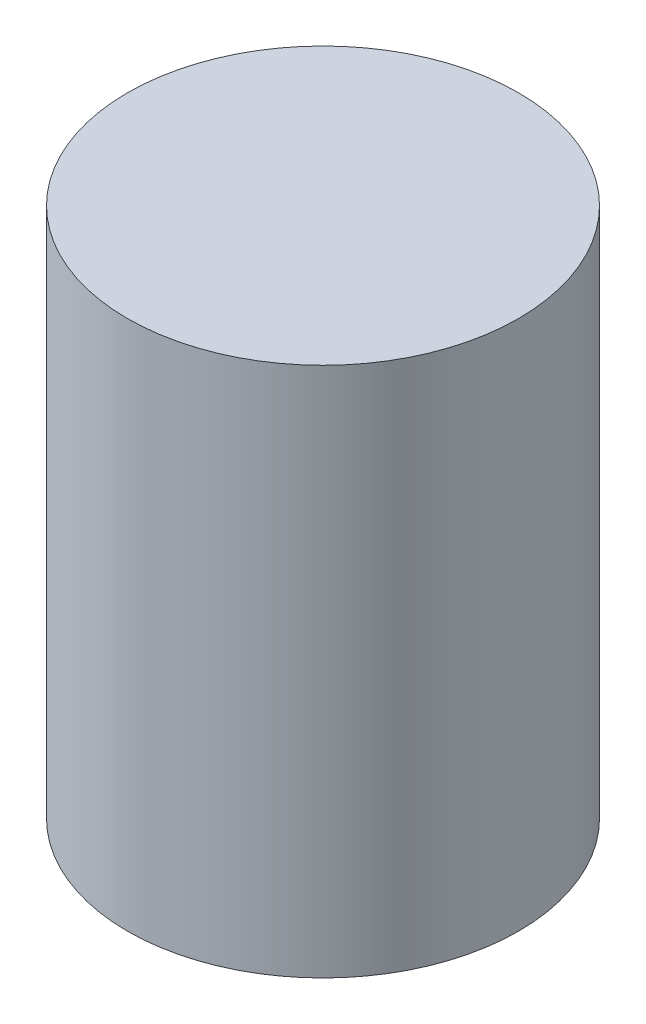
ISO-10303-21;
HEADER;
FILE_DESCRIPTION(('STEP AP214'),'2;1');
FILE_NAME('part.step','',(''),(''),'','','');
FILE_SCHEMA(('AUTOMOTIVE_DESIGN { 1 0 10303 214 1 1 1 1 }'));
ENDSEC;
DATA;
#1=APPLICATION_CONTEXT('core data for automotive mechanical design processes');
#2=APPLICATION_PROTOCOL_DEFINITION('international standard','automotive_design',2000,#1);
#3=PRODUCT_CONTEXT('',#1,'mechanical');
#4=PRODUCT('Part','Part','',(#3));
#5=PRODUCT_RELATED_PRODUCT_CATEGORY('part','',(#4));
#6=PRODUCT_DEFINITION_FORMATION('','',#4);
#7=PRODUCT_DEFINITION_CONTEXT('part definition',#1,'design');
#8=PRODUCT_DEFINITION('design','',#6,#7);
#9=PRODUCT_DEFINITION_SHAPE('','',#8);
#10=(LENGTH_UNIT() NAMED_UNIT(*) SI_UNIT(.MILLI.,.METRE.));
#11=(NAMED_UNIT(*) PLANE_ANGLE_UNIT() SI_UNIT($,.RADIAN.));
#12=(NAMED_UNIT(*) SI_UNIT($,.STERADIAN.) SOLID_ANGLE_UNIT());
#13=UNCERTAINTY_MEASURE_WITH_UNIT(LENGTH_MEASURE(1.E-05),#10,'distance_accuracy_value','');
#14=(GEOMETRIC_REPRESENTATION_CONTEXT(3) GLOBAL_UNCERTAINTY_ASSIGNED_CONTEXT((#13)) GLOBAL_UNIT_ASSIGNED_CONTEXT((#10,
#11,#12)) REPRESENTATION_CONTEXT('',''));
#15=CARTESIAN_POINT('',(0.,0.,0.));
#16=DIRECTION('',(0.,0.,1.));
#17=DIRECTION('',(1.,0.,0.));
#18=AXIS2_PLACEMENT_3D('',#15,#16,#17);
#19=CARTESIAN_POINT('',(-22.7705767790262,29.85,-24.3231161048689));
#20=DIRECTION('',(0.,-1.,0.));
#21=DIRECTION('',(0.,0.,-1.));
#22=AXIS2_PLACEMENT_3D('',#19,#20,#21);
#23=CYLINDRICAL_SURFACE('',#22,11.);
#24=CARTESIAN_POINT('',(-22.7705767790262,29.85,-24.3231161048689));
#25=DIRECTION('',(0.,1.,0.));
#26=DIRECTION('',(0.,0.,1.));
#27=AXIS2_PLACEMENT_3D('',#24,#25,#26);
#28=CIRCLE('',#27,11.);
#29=CARTESIAN_POINT('',(-22.7705767790262,29.85,-13.3231161048689));
#30=VERTEX_POINT('',#29);
#31=EDGE_CURVE('E10',#30,#30,#28,.T.);
#32=ORIENTED_EDGE('',*,*,#31,.F.);
#33=EDGE_LOOP('',(#32));
#34=FACE_BOUND('',#33,.T.);
#35=CARTESIAN_POINT('',(-22.7705767790262,0.,-24.3231161048689));
#36=DIRECTION('',(0.,1.,0.));
#37=DIRECTION('',(0.,0.,1.));
#38=AXIS2_PLACEMENT_3D('',#35,#36,#37);
#39=CIRCLE('',#38,11.);
#40=CARTESIAN_POINT('',(-22.7705767790262,0.,-13.3231161048689));
#41=VERTEX_POINT('',#40);
#42=EDGE_CURVE('E43',#41,#41,#39,.T.);
#43=ORIENTED_EDGE('',*,*,#42,.T.);
#44=EDGE_LOOP('',(#43));
#45=FACE_BOUND('',#44,.T.);
#46=ADVANCED_FACE('F40',(#34,#45),#23,.T.);
#47=CARTESIAN_POINT('',(-22.7705767790262,29.85,-24.3231161048689));
#48=DIRECTION('',(0.,1.,0.));
#49=DIRECTION('',(0.,0.,1.));
#50=AXIS2_PLACEMENT_3D('',#47,#48,#49);
#51=PLANE('',#50);
#52=ORIENTED_EDGE('',*,*,#31,.T.);
#53=EDGE_LOOP('',(#52));
#54=FACE_BOUND('',#53,.T.);
#55=ADVANCED_FACE('F55',(#54),#51,.T.);
#56=CARTESIAN_POINT('',(-22.7705767790262,0.,-24.3231161048689));
#57=DIRECTION('',(0.,1.,0.));
#58=DIRECTION('',(0.,0.,1.));
#59=AXIS2_PLACEMENT_3D('',#56,#57,#58);
#60=PLANE('',#59);
#61=ORIENTED_EDGE('',*,*,#42,.F.);
#62=EDGE_LOOP('',(#61));
#63=FACE_BOUND('',#62,.T.);
#64=ADVANCED_FACE('F53',(#63),#60,.F.);
#65=CLOSED_SHELL('',(#46,#55,#64));
#66=MANIFOLD_SOLID_BREP('B2',#65);
#67=ADVANCED_BREP_SHAPE_REPRESENTATION('',(#18,#66),#14);
#68=SHAPE_DEFINITION_REPRESENTATION(#9,#67);
ENDSEC;
END-ISO-10303-21;
